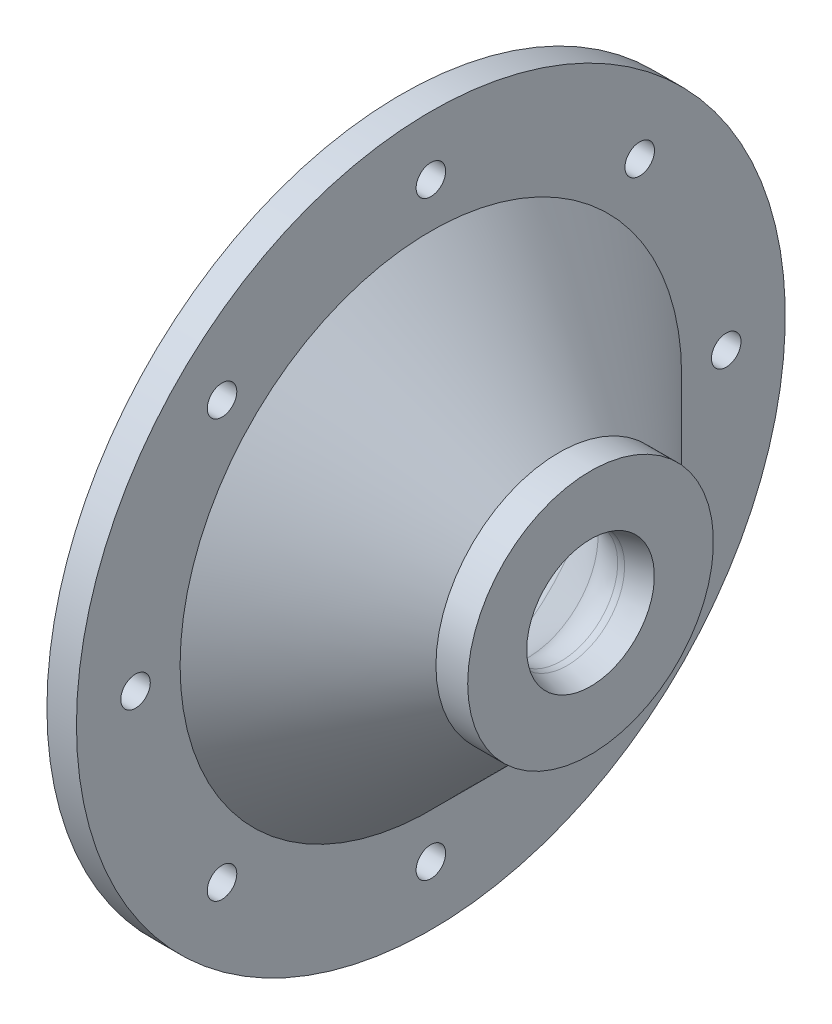
ISO-10303-21;
HEADER;
FILE_DESCRIPTION(('STEP AP214'),'2;1');
FILE_NAME('part.step','',(''),(''),'','','');
FILE_SCHEMA(('AUTOMOTIVE_DESIGN { 1 0 10303 214 1 1 1 1 }'));
ENDSEC;
DATA;
#1=APPLICATION_CONTEXT('core data for automotive mechanical design processes');
#2=APPLICATION_PROTOCOL_DEFINITION('international standard','automotive_design',2000,#1);
#3=PRODUCT_CONTEXT('',#1,'mechanical');
#4=PRODUCT('Part','Part','',(#3));
#5=PRODUCT_RELATED_PRODUCT_CATEGORY('part','',(#4));
#6=PRODUCT_DEFINITION_FORMATION('','',#4);
#7=PRODUCT_DEFINITION_CONTEXT('part definition',#1,'design');
#8=PRODUCT_DEFINITION('design','',#6,#7);
#9=PRODUCT_DEFINITION_SHAPE('','',#8);
#10=(LENGTH_UNIT() NAMED_UNIT(*) SI_UNIT(.MILLI.,.METRE.));
#11=(NAMED_UNIT(*) PLANE_ANGLE_UNIT() SI_UNIT($,.RADIAN.));
#12=(NAMED_UNIT(*) SI_UNIT($,.STERADIAN.) SOLID_ANGLE_UNIT());
#13=UNCERTAINTY_MEASURE_WITH_UNIT(LENGTH_MEASURE(1.E-05),#10,'distance_accuracy_value','');
#14=(GEOMETRIC_REPRESENTATION_CONTEXT(3) GLOBAL_UNCERTAINTY_ASSIGNED_CONTEXT((#13)) GLOBAL_UNIT_ASSIGNED_CONTEXT((#10,
#11,#12)) REPRESENTATION_CONTEXT('',''));
#15=CARTESIAN_POINT('',(0.,0.,0.));
#16=DIRECTION('',(0.,0.,1.));
#17=DIRECTION('',(1.,0.,0.));
#18=AXIS2_PLACEMENT_3D('',#15,#16,#17);
#19=CARTESIAN_POINT('',(3.175,38.1,0.));
#20=DIRECTION('',(-1.,0.,0.));
#21=DIRECTION('',(0.,0.,1.));
#22=AXIS2_PLACEMENT_3D('',#19,#20,#21);
#23=PLANE('',#22);
#24=CARTESIAN_POINT('',(3.175,-1.10854532508269E-13,31.75));
#25=DIRECTION('',(1.,0.,0.));
#26=DIRECTION('',(0.,1.,0.));
#27=AXIS2_PLACEMENT_3D('',#24,#25,#26);
#28=CIRCLE('',#27,1.58749999999999);
#29=CARTESIAN_POINT('',(3.175,1.58749999999988,31.75));
#30=VERTEX_POINT('',#29);
#31=EDGE_CURVE('E104',#30,#30,#28,.T.);
#32=ORIENTED_EDGE('',*,*,#31,.F.);
#33=EDGE_LOOP('',(#32));
#34=FACE_BOUND('',#33,.T.);
#35=CARTESIAN_POINT('',(3.175,-22.450640302673,22.4506403026728));
#36=DIRECTION('',(1.,0.,0.));
#37=DIRECTION('',(0.,0.707106781186544,0.707106781186551));
#38=AXIS2_PLACEMENT_3D('',#35,#36,#37);
#39=CIRCLE('',#38,1.58749999999999);
#40=CARTESIAN_POINT('',(3.175,-21.3281082875394,23.5731723178064));
#41=VERTEX_POINT('',#40);
#42=EDGE_CURVE('E123',#41,#41,#39,.T.);
#43=ORIENTED_EDGE('',*,*,#42,.F.);
#44=EDGE_LOOP('',(#43));
#45=FACE_BOUND('',#44,.T.);
#46=CARTESIAN_POINT('',(3.175,-31.75,0.));
#47=DIRECTION('',(1.,0.,0.));
#48=DIRECTION('',(0.,0.,1.));
#49=AXIS2_PLACEMENT_3D('',#46,#47,#48);
#50=CIRCLE('',#49,1.58749999999999);
#51=CARTESIAN_POINT('',(3.175,-31.75,1.58749999999999));
#52=VERTEX_POINT('',#51);
#53=EDGE_CURVE('E115',#52,#52,#50,.T.);
#54=ORIENTED_EDGE('',*,*,#53,.F.);
#55=EDGE_LOOP('',(#54));
#56=FACE_BOUND('',#55,.T.);
#57=CARTESIAN_POINT('',(3.175,-22.4506403026727,-22.4506403026731));
#58=DIRECTION('',(1.,0.,0.));
#59=DIRECTION('',(0.,-0.707106781186554,0.707106781186541));
#60=AXIS2_PLACEMENT_3D('',#57,#58,#59);
#61=CIRCLE('',#60,1.58749999999999);
#62=CARTESIAN_POINT('',(3.175,-23.5731723178063,-21.3281082875395));
#63=VERTEX_POINT('',#62);
#64=EDGE_CURVE('E105',#63,#63,#61,.T.);
#65=ORIENTED_EDGE('',*,*,#64,.F.);
#66=EDGE_LOOP('',(#65));
#67=FACE_BOUND('',#66,.T.);
#68=CARTESIAN_POINT('',(3.175,3.32563597524808E-13,-31.75));
#69=DIRECTION('',(1.,0.,0.));
#70=DIRECTION('',(0.,-1.,0.));
#71=AXIS2_PLACEMENT_3D('',#68,#69,#70);
#72=CIRCLE('',#71,1.58749999999999);
#73=CARTESIAN_POINT('',(3.175,-1.58749999999966,-31.75));
#74=VERTEX_POINT('',#73);
#75=EDGE_CURVE('E114',#74,#74,#72,.T.);
#76=ORIENTED_EDGE('',*,*,#75,.F.);
#77=EDGE_LOOP('',(#76));
#78=FACE_BOUND('',#77,.T.);
#79=CARTESIAN_POINT('',(3.175,22.4506403026732,-22.4506403026726));
#80=DIRECTION('',(1.,0.,0.));
#81=DIRECTION('',(0.,-0.707106781186539,-0.707106781186556));
#82=AXIS2_PLACEMENT_3D('',#79,#80,#81);
#83=CIRCLE('',#82,1.58749999999999);
#84=CARTESIAN_POINT('',(3.175,21.3281082875395,-23.5731723178063));
#85=VERTEX_POINT('',#84);
#86=EDGE_CURVE('E137',#85,#85,#83,.T.);
#87=ORIENTED_EDGE('',*,*,#86,.F.);
#88=EDGE_LOOP('',(#87));
#89=FACE_BOUND('',#88,.T.);
#90=CARTESIAN_POINT('',(3.175,22.4506403026728,22.4506403026729));
#91=DIRECTION('',(1.,0.,0.));
#92=DIRECTION('',(0.,0.707106781186549,-0.707106781186546));
#93=AXIS2_PLACEMENT_3D('',#90,#91,#92);
#94=CIRCLE('',#93,1.58749999999999);
#95=CARTESIAN_POINT('',(3.175,23.5731723178065,21.3281082875393));
#96=VERTEX_POINT('',#95);
#97=EDGE_CURVE('E96',#96,#96,#94,.T.);
#98=ORIENTED_EDGE('',*,*,#97,.F.);
#99=EDGE_LOOP('',(#98));
#100=FACE_BOUND('',#99,.T.);
#101=CARTESIAN_POINT('',(3.175,31.75,0.));
#102=DIRECTION('',(1.,0.,0.));
#103=DIRECTION('',(0.,0.,-1.));
#104=AXIS2_PLACEMENT_3D('',#101,#102,#103);
#105=CIRCLE('',#104,1.58749999999999);
#106=CARTESIAN_POINT('',(3.175,31.75,-1.58749999999999));
#107=VERTEX_POINT('',#106);
#108=EDGE_CURVE('E92',#107,#107,#105,.T.);
#109=ORIENTED_EDGE('',*,*,#108,.F.);
#110=EDGE_LOOP('',(#109));
#111=FACE_BOUND('',#110,.T.);
#112=CARTESIAN_POINT('',(3.175,0.,0.));
#113=DIRECTION('',(-1.,0.,0.));
#114=DIRECTION('',(0.,0.,1.));
#115=AXIS2_PLACEMENT_3D('',#112,#113,#114);
#116=CIRCLE('',#115,38.1);
#117=CARTESIAN_POINT('',(3.175,0.,38.1));
#118=VERTEX_POINT('',#117);
#119=EDGE_CURVE('E10',#118,#118,#116,.T.);
#120=ORIENTED_EDGE('',*,*,#119,.F.);
#121=EDGE_LOOP('',(#120));
#122=FACE_BOUND('',#121,.T.);
#123=CARTESIAN_POINT('',(3.175,0.,0.));
#124=DIRECTION('',(-1.,0.,0.));
#125=DIRECTION('',(0.,0.,1.));
#126=AXIS2_PLACEMENT_3D('',#123,#124,#125);
#127=CIRCLE('',#126,26.9594610179245);
#128=CARTESIAN_POINT('',(3.175,0.,26.9594610179245));
#129=VERTEX_POINT('',#128);
#130=EDGE_CURVE('E84',#129,#129,#127,.T.);
#131=ORIENTED_EDGE('',*,*,#130,.T.);
#132=EDGE_LOOP('',(#131));
#133=FACE_BOUND('',#132,.T.);
#134=ADVANCED_FACE('F37',(#34,#45,#56,#67,#78,#89,#100,#111,#122,#133),#23,.F.);
#135=CARTESIAN_POINT('',(0.,0.,0.));
#136=DIRECTION('',(-1.,0.,0.));
#137=DIRECTION('',(0.,0.,1.));
#138=AXIS2_PLACEMENT_3D('',#135,#136,#137);
#139=CYLINDRICAL_SURFACE('',#138,38.1);
#140=CARTESIAN_POINT('',(0.,0.,0.));
#141=DIRECTION('',(-1.,0.,0.));
#142=DIRECTION('',(0.,0.,1.));
#143=AXIS2_PLACEMENT_3D('',#140,#141,#142);
#144=CIRCLE('',#143,38.1);
#145=CARTESIAN_POINT('',(0.,0.,38.1));
#146=VERTEX_POINT('',#145);
#147=EDGE_CURVE('E44',#146,#146,#144,.T.);
#148=ORIENTED_EDGE('',*,*,#147,.F.);
#149=EDGE_LOOP('',(#148));
#150=FACE_BOUND('',#149,.T.);
#151=ORIENTED_EDGE('',*,*,#119,.T.);
#152=EDGE_LOOP('',(#151));
#153=FACE_BOUND('',#152,.T.);
#154=ADVANCED_FACE('F166',(#150,#153),#139,.T.);
#155=CARTESIAN_POINT('',(0.,19.05,0.));
#156=DIRECTION('',(1.,0.,0.));
#157=DIRECTION('',(0.,0.,-1.));
#158=AXIS2_PLACEMENT_3D('',#155,#156,#157);
#159=PLANE('',#158);
#160=CARTESIAN_POINT('',(0.,-1.10854532508269E-13,31.75));
#161=DIRECTION('',(1.,0.,0.));
#162=DIRECTION('',(0.,1.,0.));
#163=AXIS2_PLACEMENT_3D('',#160,#161,#162);
#164=CIRCLE('',#163,1.5875);
#165=CARTESIAN_POINT('',(0.,1.58749999999989,31.75));
#166=VERTEX_POINT('',#165);
#167=EDGE_CURVE('E127',#166,#166,#164,.T.);
#168=ORIENTED_EDGE('',*,*,#167,.T.);
#169=EDGE_LOOP('',(#168));
#170=FACE_BOUND('',#169,.T.);
#171=CARTESIAN_POINT('',(0.,-22.450640302673,22.4506403026728));
#172=DIRECTION('',(1.,0.,0.));
#173=DIRECTION('',(0.,0.707106781186544,0.707106781186551));
#174=AXIS2_PLACEMENT_3D('',#171,#172,#173);
#175=CIRCLE('',#174,1.5875);
#176=CARTESIAN_POINT('',(0.,-21.3281082875394,23.5731723178064));
#177=VERTEX_POINT('',#176);
#178=EDGE_CURVE('E119',#177,#177,#175,.T.);
#179=ORIENTED_EDGE('',*,*,#178,.T.);
#180=EDGE_LOOP('',(#179));
#181=FACE_BOUND('',#180,.T.);
#182=CARTESIAN_POINT('',(0.,-31.75,0.));
#183=DIRECTION('',(1.,0.,0.));
#184=DIRECTION('',(0.,0.,1.));
#185=AXIS2_PLACEMENT_3D('',#182,#183,#184);
#186=CIRCLE('',#185,1.5875);
#187=CARTESIAN_POINT('',(0.,-31.75,1.5875));
#188=VERTEX_POINT('',#187);
#189=EDGE_CURVE('E109',#188,#188,#186,.T.);
#190=ORIENTED_EDGE('',*,*,#189,.T.);
#191=EDGE_LOOP('',(#190));
#192=FACE_BOUND('',#191,.T.);
#193=CARTESIAN_POINT('',(0.,-22.4506403026727,-22.4506403026731));
#194=DIRECTION('',(1.,0.,0.));
#195=DIRECTION('',(0.,-0.707106781186554,0.707106781186541));
#196=AXIS2_PLACEMENT_3D('',#193,#194,#195);
#197=CIRCLE('',#196,1.5875);
#198=CARTESIAN_POINT('',(0.,-23.5731723178063,-21.3281082875394));
#199=VERTEX_POINT('',#198);
#200=EDGE_CURVE('E110',#199,#199,#197,.T.);
#201=ORIENTED_EDGE('',*,*,#200,.T.);
#202=EDGE_LOOP('',(#201));
#203=FACE_BOUND('',#202,.T.);
#204=CARTESIAN_POINT('',(0.,3.32563597524808E-13,-31.75));
#205=DIRECTION('',(1.,0.,0.));
#206=DIRECTION('',(0.,-1.,0.));
#207=AXIS2_PLACEMENT_3D('',#204,#205,#206);
#208=CIRCLE('',#207,1.5875);
#209=CARTESIAN_POINT('',(0.,-1.58749999999967,-31.75));
#210=VERTEX_POINT('',#209);
#211=EDGE_CURVE('E141',#210,#210,#208,.T.);
#212=ORIENTED_EDGE('',*,*,#211,.T.);
#213=EDGE_LOOP('',(#212));
#214=FACE_BOUND('',#213,.T.);
#215=CARTESIAN_POINT('',(0.,22.4506403026732,-22.4506403026726));
#216=DIRECTION('',(1.,0.,0.));
#217=DIRECTION('',(0.,-0.707106781186539,-0.707106781186556));
#218=AXIS2_PLACEMENT_3D('',#215,#216,#217);
#219=CIRCLE('',#218,1.5875);
#220=CARTESIAN_POINT('',(0.,21.3281082875395,-23.5731723178063));
#221=VERTEX_POINT('',#220);
#222=EDGE_CURVE('E142',#221,#221,#219,.T.);
#223=ORIENTED_EDGE('',*,*,#222,.T.);
#224=EDGE_LOOP('',(#223));
#225=FACE_BOUND('',#224,.T.);
#226=CARTESIAN_POINT('',(0.,22.4506403026728,22.4506403026729));
#227=DIRECTION('',(1.,0.,0.));
#228=DIRECTION('',(0.,0.707106781186549,-0.707106781186546));
#229=AXIS2_PLACEMENT_3D('',#226,#227,#228);
#230=CIRCLE('',#229,1.5875);
#231=CARTESIAN_POINT('',(0.,23.5731723178065,21.3281082875393));
#232=VERTEX_POINT('',#231);
#233=EDGE_CURVE('E100',#232,#232,#230,.T.);
#234=ORIENTED_EDGE('',*,*,#233,.T.);
#235=EDGE_LOOP('',(#234));
#236=FACE_BOUND('',#235,.T.);
#237=CARTESIAN_POINT('',(0.,31.75,0.));
#238=DIRECTION('',(1.,0.,0.));
#239=DIRECTION('',(0.,0.,-1.));
#240=AXIS2_PLACEMENT_3D('',#237,#238,#239);
#241=CIRCLE('',#240,1.5875);
#242=CARTESIAN_POINT('',(0.,31.75,-1.5875));
#243=VERTEX_POINT('',#242);
#244=EDGE_CURVE('E88',#243,#243,#241,.T.);
#245=ORIENTED_EDGE('',*,*,#244,.T.);
#246=EDGE_LOOP('',(#245));
#247=FACE_BOUND('',#246,.T.);
#248=CARTESIAN_POINT('',(0.,0.,0.));
#249=DIRECTION('',(-1.,0.,0.));
#250=DIRECTION('',(0.,0.,1.));
#251=AXIS2_PLACEMENT_3D('',#248,#249,#250);
#252=CIRCLE('',#251,19.05);
#253=CARTESIAN_POINT('',(0.,0.,19.05));
#254=VERTEX_POINT('',#253);
#255=EDGE_CURVE('E49',#254,#254,#252,.T.);
#256=ORIENTED_EDGE('',*,*,#255,.F.);
#257=EDGE_LOOP('',(#256));
#258=FACE_BOUND('',#257,.T.);
#259=ORIENTED_EDGE('',*,*,#147,.T.);
#260=EDGE_LOOP('',(#259));
#261=FACE_BOUND('',#260,.T.);
#262=ADVANCED_FACE('F153',(#170,#181,#192,#203,#214,#225,#236,#247,#258,#261),#159,.F.);
#263=CARTESIAN_POINT('',(0.,0.,0.));
#264=DIRECTION('',(-1.,0.,0.));
#265=DIRECTION('',(0.,0.,1.));
#266=AXIS2_PLACEMENT_3D('',#263,#264,#265);
#267=TOROIDAL_SURFACE('',#266,13.97,5.08);
#268=CARTESIAN_POINT('',(3.59210244842767,0.,0.));
#269=DIRECTION('',(-1.,0.,0.));
#270=DIRECTION('',(0.,0.,1.));
#271=AXIS2_PLACEMENT_3D('',#268,#269,#270);
#272=CIRCLE('',#271,17.5621024484277);
#273=CARTESIAN_POINT('',(3.59210244842767,0.,17.5621024484277));
#274=VERTEX_POINT('',#273);
#275=EDGE_CURVE('E54',#274,#274,#272,.T.);
#276=ORIENTED_EDGE('',*,*,#275,.F.);
#277=EDGE_LOOP('',(#276));
#278=FACE_BOUND('',#277,.T.);
#279=ORIENTED_EDGE('',*,*,#255,.T.);
#280=EDGE_LOOP('',(#279));
#281=FACE_BOUND('',#280,.T.);
#282=ADVANCED_FACE('F217',(#278,#281),#267,.F.);
#283=CARTESIAN_POINT('',(3.59210244842767,0.,0.));
#284=DIRECTION('',(-1.,0.,0.));
#285=DIRECTION('',(0.,0.,1.));
#286=AXIS2_PLACEMENT_3D('',#283,#284,#285);
#287=CONICAL_SURFACE('',#286,17.5621024484277,0.78539816339745);
#288=CARTESIAN_POINT('',(13.5703073452829,0.,0.));
#289=DIRECTION('',(-1.,0.,0.));
#290=DIRECTION('',(0.,0.,1.));
#291=AXIS2_PLACEMENT_3D('',#288,#289,#290);
#292=CIRCLE('',#291,7.58389755157235);
#293=CARTESIAN_POINT('',(13.5703073452829,0.,7.58389755157235));
#294=VERTEX_POINT('',#293);
#295=EDGE_CURVE('E60',#294,#294,#292,.T.);
#296=ORIENTED_EDGE('',*,*,#295,.F.);
#297=EDGE_LOOP('',(#296));
#298=FACE_BOUND('',#297,.T.);
#299=ORIENTED_EDGE('',*,*,#275,.T.);
#300=EDGE_LOOP('',(#299));
#301=FACE_BOUND('',#300,.T.);
#302=ADVANCED_FACE('F211',(#298,#301),#287,.F.);
#303=CARTESIAN_POINT('',(17.1624097937106,0.,0.));
#304=DIRECTION('',(-1.,0.,0.));
#305=DIRECTION('',(0.,0.,1.));
#306=AXIS2_PLACEMENT_3D('',#303,#304,#305);
#307=TOROIDAL_SURFACE('',#306,11.176,5.08);
#308=CARTESIAN_POINT('',(17.1624097937106,0.,0.));
#309=DIRECTION('',(-1.,0.,0.));
#310=DIRECTION('',(0.,0.,1.));
#311=AXIS2_PLACEMENT_3D('',#308,#309,#310);
#312=CIRCLE('',#311,6.096);
#313=CARTESIAN_POINT('',(17.1624097937106,0.,6.096));
#314=VERTEX_POINT('',#313);
#315=EDGE_CURVE('E64',#314,#314,#312,.T.);
#316=ORIENTED_EDGE('',*,*,#315,.F.);
#317=EDGE_LOOP('',(#316));
#318=FACE_BOUND('',#317,.T.);
#319=ORIENTED_EDGE('',*,*,#295,.T.);
#320=EDGE_LOOP('',(#319));
#321=FACE_BOUND('',#320,.T.);
#322=ADVANCED_FACE('F205',(#318,#321),#307,.T.);
#323=CARTESIAN_POINT('',(17.1624097937106,0.,0.));
#324=DIRECTION('',(-1.,0.,0.));
#325=DIRECTION('',(0.,0.,1.));
#326=AXIS2_PLACEMENT_3D('',#323,#324,#325);
#327=TOROIDAL_SURFACE('',#326,8.636,2.54);
#328=CARTESIAN_POINT('',(17.819810168271,0.,0.));
#329=DIRECTION('',(-1.,0.,0.));
#330=DIRECTION('',(0.,0.,1.));
#331=AXIS2_PLACEMENT_3D('',#328,#329,#330);
#332=CIRCLE('',#331,6.18254840122577);
#333=CARTESIAN_POINT('',(17.819810168271,0.,6.18254840122577));
#334=VERTEX_POINT('',#333);
#335=EDGE_CURVE('E68',#334,#334,#332,.T.);
#336=ORIENTED_EDGE('',*,*,#335,.F.);
#337=EDGE_LOOP('',(#336));
#338=FACE_BOUND('',#337,.T.);
#339=ORIENTED_EDGE('',*,*,#315,.T.);
#340=EDGE_LOOP('',(#339));
#341=FACE_BOUND('',#340,.T.);
#342=ADVANCED_FACE('F199',(#338,#341),#327,.T.);
#343=CARTESIAN_POINT('',(17.819810168271,0.,0.));
#344=DIRECTION('',(1.,0.,0.));
#345=DIRECTION('',(0.,0.,-1.));
#346=AXIS2_PLACEMENT_3D('',#343,#344,#345);
#347=CONICAL_SURFACE('',#346,6.18254840122577,0.261799387799151);
#348=CARTESIAN_POINT('',(20.3406298529501,0.,0.));
#349=DIRECTION('',(-1.,0.,0.));
#350=DIRECTION('',(0.,0.,1.));
#351=AXIS2_PLACEMENT_3D('',#348,#349,#350);
#352=CIRCLE('',#351,6.858);
#353=CARTESIAN_POINT('',(20.3406298529501,0.,6.858));
#354=VERTEX_POINT('',#353);
#355=EDGE_CURVE('E72',#354,#354,#352,.T.);
#356=ORIENTED_EDGE('',*,*,#355,.F.);
#357=EDGE_LOOP('',(#356));
#358=FACE_BOUND('',#357,.T.);
#359=ORIENTED_EDGE('',*,*,#335,.T.);
#360=EDGE_LOOP('',(#359));
#361=FACE_BOUND('',#360,.T.);
#362=ADVANCED_FACE('F193',(#358,#361),#347,.F.);
#363=CARTESIAN_POINT('',(20.3406298529501,6.858,0.));
#364=DIRECTION('',(-1.,0.,0.));
#365=DIRECTION('',(0.,0.,1.));
#366=AXIS2_PLACEMENT_3D('',#363,#364,#365);
#367=PLANE('',#366);
#368=CARTESIAN_POINT('',(20.3406298529501,0.,0.));
#369=DIRECTION('',(-1.,0.,0.));
#370=DIRECTION('',(0.,0.,1.));
#371=AXIS2_PLACEMENT_3D('',#368,#369,#370);
#372=CIRCLE('',#371,13.208);
#373=CARTESIAN_POINT('',(20.3406298529501,0.,13.208));
#374=VERTEX_POINT('',#373);
#375=EDGE_CURVE('E76',#374,#374,#372,.T.);
#376=ORIENTED_EDGE('',*,*,#375,.F.);
#377=EDGE_LOOP('',(#376));
#378=FACE_BOUND('',#377,.T.);
#379=ORIENTED_EDGE('',*,*,#355,.T.);
#380=EDGE_LOOP('',(#379));
#381=FACE_BOUND('',#380,.T.);
#382=ADVANCED_FACE('F187',(#378,#381),#367,.F.);
#383=CARTESIAN_POINT('',(0.,0.,0.));
#384=DIRECTION('',(-1.,0.,0.));
#385=DIRECTION('',(0.,0.,1.));
#386=AXIS2_PLACEMENT_3D('',#383,#384,#385);
#387=CYLINDRICAL_SURFACE('',#386,13.208);
#388=CARTESIAN_POINT('',(16.9264610179244,0.,0.));
#389=DIRECTION('',(-1.,0.,0.));
#390=DIRECTION('',(0.,0.,1.));
#391=AXIS2_PLACEMENT_3D('',#388,#389,#390);
#392=CIRCLE('',#391,13.208);
#393=CARTESIAN_POINT('',(16.9264610179244,0.,13.208));
#394=VERTEX_POINT('',#393);
#395=EDGE_CURVE('E80',#394,#394,#392,.T.);
#396=ORIENTED_EDGE('',*,*,#395,.F.);
#397=EDGE_LOOP('',(#396));
#398=FACE_BOUND('',#397,.T.);
#399=ORIENTED_EDGE('',*,*,#375,.T.);
#400=EDGE_LOOP('',(#399));
#401=FACE_BOUND('',#400,.T.);
#402=ADVANCED_FACE('F181',(#398,#401),#387,.T.);
#403=CARTESIAN_POINT('',(16.9264610179244,0.,0.));
#404=DIRECTION('',(-1.,0.,0.));
#405=DIRECTION('',(0.,0.,1.));
#406=AXIS2_PLACEMENT_3D('',#403,#404,#405);
#407=CONICAL_SURFACE('',#406,13.208,0.78539816339745);
#408=ORIENTED_EDGE('',*,*,#130,.F.);
#409=EDGE_LOOP('',(#408));
#410=FACE_BOUND('',#409,.T.);
#411=ORIENTED_EDGE('',*,*,#395,.T.);
#412=EDGE_LOOP('',(#411));
#413=FACE_BOUND('',#412,.T.);
#414=ADVANCED_FACE('F177',(#410,#413),#407,.T.);
#415=CARTESIAN_POINT('',(3.175,31.75,0.));
#416=DIRECTION('',(1.,0.,0.));
#417=DIRECTION('',(0.,0.,-1.));
#418=AXIS2_PLACEMENT_3D('',#415,#416,#417);
#419=CYLINDRICAL_SURFACE('',#418,1.5875);
#420=ORIENTED_EDGE('',*,*,#244,.F.);
#421=EDGE_LOOP('',(#420));
#422=FACE_BOUND('',#421,.T.);
#423=ORIENTED_EDGE('',*,*,#108,.T.);
#424=EDGE_LOOP('',(#423));
#425=FACE_BOUND('',#424,.T.);
#426=ADVANCED_FACE('F180',(#422,#425),#419,.F.);
#427=CARTESIAN_POINT('',(3.175,22.4506403026728,22.4506403026729));
#428=DIRECTION('',(1.,0.,0.));
#429=DIRECTION('',(0.,0.707106781186549,-0.707106781186546));
#430=AXIS2_PLACEMENT_3D('',#427,#428,#429);
#431=CYLINDRICAL_SURFACE('',#430,1.5875);
#432=ORIENTED_EDGE('',*,*,#233,.F.);
#433=EDGE_LOOP('',(#432));
#434=FACE_BOUND('',#433,.T.);
#435=ORIENTED_EDGE('',*,*,#97,.T.);
#436=EDGE_LOOP('',(#435));
#437=FACE_BOUND('',#436,.T.);
#438=ADVANCED_FACE('F237',(#434,#437),#431,.F.);
#439=CARTESIAN_POINT('',(3.175,22.4506403026732,-22.4506403026726));
#440=DIRECTION('',(1.,0.,0.));
#441=DIRECTION('',(0.,-0.707106781186539,-0.707106781186556));
#442=AXIS2_PLACEMENT_3D('',#439,#440,#441);
#443=CYLINDRICAL_SURFACE('',#442,1.5875);
#444=ORIENTED_EDGE('',*,*,#222,.F.);
#445=EDGE_LOOP('',(#444));
#446=FACE_BOUND('',#445,.T.);
#447=ORIENTED_EDGE('',*,*,#86,.T.);
#448=EDGE_LOOP('',(#447));
#449=FACE_BOUND('',#448,.T.);
#450=ADVANCED_FACE('F160',(#446,#449),#443,.F.);
#451=CARTESIAN_POINT('',(3.175,3.32563597524808E-13,-31.75));
#452=DIRECTION('',(1.,0.,0.));
#453=DIRECTION('',(0.,-1.,0.));
#454=AXIS2_PLACEMENT_3D('',#451,#452,#453);
#455=CYLINDRICAL_SURFACE('',#454,1.5875);
#456=ORIENTED_EDGE('',*,*,#211,.F.);
#457=EDGE_LOOP('',(#456));
#458=FACE_BOUND('',#457,.T.);
#459=ORIENTED_EDGE('',*,*,#75,.T.);
#460=EDGE_LOOP('',(#459));
#461=FACE_BOUND('',#460,.T.);
#462=ADVANCED_FACE('F156',(#458,#461),#455,.F.);
#463=CARTESIAN_POINT('',(3.175,-22.4506403026727,-22.4506403026731));
#464=DIRECTION('',(1.,0.,0.));
#465=DIRECTION('',(0.,-0.707106781186554,0.707106781186541));
#466=AXIS2_PLACEMENT_3D('',#463,#464,#465);
#467=CYLINDRICAL_SURFACE('',#466,1.5875);
#468=ORIENTED_EDGE('',*,*,#200,.F.);
#469=EDGE_LOOP('',(#468));
#470=FACE_BOUND('',#469,.T.);
#471=ORIENTED_EDGE('',*,*,#64,.T.);
#472=EDGE_LOOP('',(#471));
#473=FACE_BOUND('',#472,.T.);
#474=ADVANCED_FACE('F159',(#470,#473),#467,.F.);
#475=CARTESIAN_POINT('',(3.175,-31.75,0.));
#476=DIRECTION('',(1.,0.,0.));
#477=DIRECTION('',(0.,0.,1.));
#478=AXIS2_PLACEMENT_3D('',#475,#476,#477);
#479=CYLINDRICAL_SURFACE('',#478,1.5875);
#480=ORIENTED_EDGE('',*,*,#189,.F.);
#481=EDGE_LOOP('',(#480));
#482=FACE_BOUND('',#481,.T.);
#483=ORIENTED_EDGE('',*,*,#53,.T.);
#484=EDGE_LOOP('',(#483));
#485=FACE_BOUND('',#484,.T.);
#486=ADVANCED_FACE('F244',(#482,#485),#479,.F.);
#487=CARTESIAN_POINT('',(3.175,-22.450640302673,22.4506403026728));
#488=DIRECTION('',(1.,0.,0.));
#489=DIRECTION('',(0.,0.707106781186544,0.707106781186551));
#490=AXIS2_PLACEMENT_3D('',#487,#488,#489);
#491=CYLINDRICAL_SURFACE('',#490,1.5875);
#492=ORIENTED_EDGE('',*,*,#178,.F.);
#493=EDGE_LOOP('',(#492));
#494=FACE_BOUND('',#493,.T.);
#495=ORIENTED_EDGE('',*,*,#42,.T.);
#496=EDGE_LOOP('',(#495));
#497=FACE_BOUND('',#496,.T.);
#498=ADVANCED_FACE('F248',(#494,#497),#491,.F.);
#499=CARTESIAN_POINT('',(3.175,-1.10854532508269E-13,31.75));
#500=DIRECTION('',(1.,0.,0.));
#501=DIRECTION('',(0.,1.,0.));
#502=AXIS2_PLACEMENT_3D('',#499,#500,#501);
#503=CYLINDRICAL_SURFACE('',#502,1.5875);
#504=ORIENTED_EDGE('',*,*,#167,.F.);
#505=EDGE_LOOP('',(#504));
#506=FACE_BOUND('',#505,.T.);
#507=ORIENTED_EDGE('',*,*,#31,.T.);
#508=EDGE_LOOP('',(#507));
#509=FACE_BOUND('',#508,.T.);
#510=ADVANCED_FACE('F252',(#506,#509),#503,.F.);
#511=CLOSED_SHELL('',(#134,#154,#262,#282,#302,#322,#342,#362,#382,#402,#414,#426,#438,#450,
#462,#474,#486,#498,#510));
#512=MANIFOLD_SOLID_BREP('B2',#511);
#513=ADVANCED_BREP_SHAPE_REPRESENTATION('',(#18,#512),#14);
#514=SHAPE_DEFINITION_REPRESENTATION(#9,#513);
ENDSEC;
END-ISO-10303-21;
